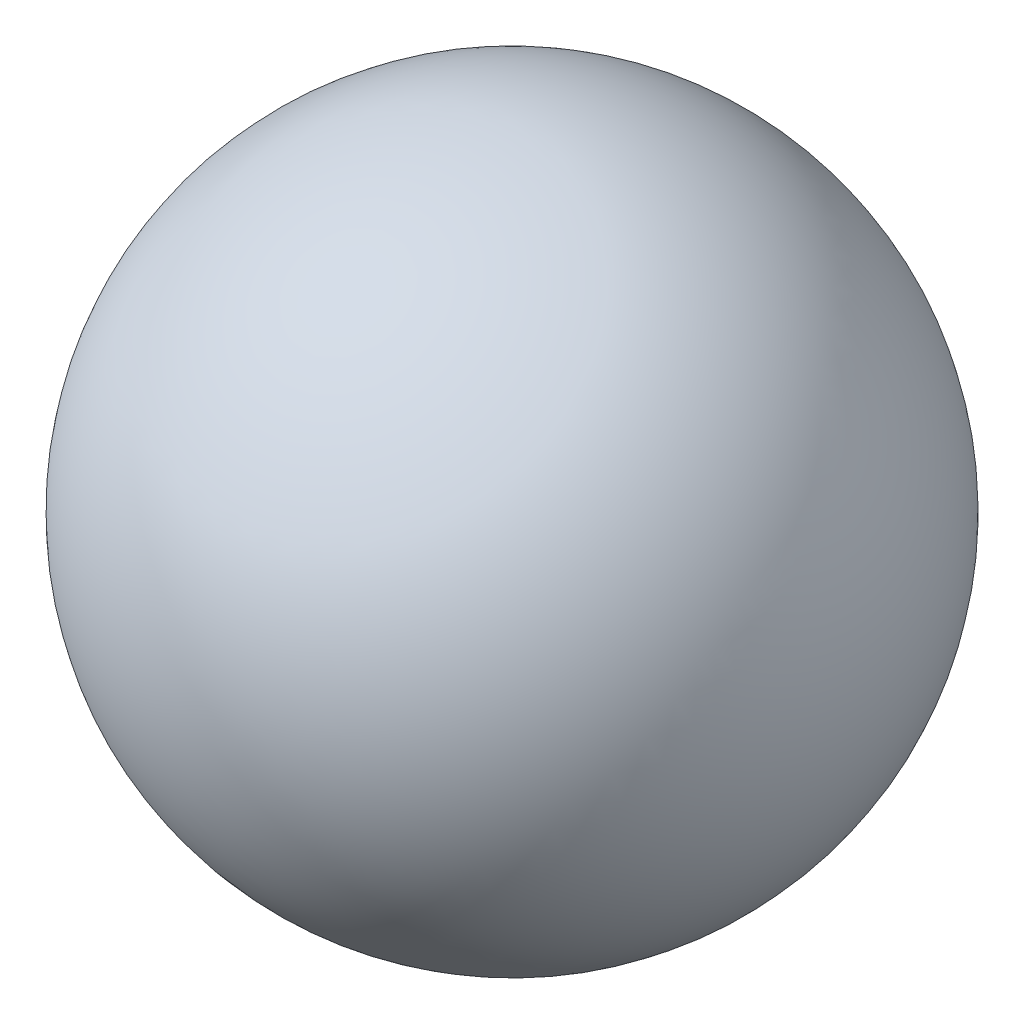
ISO-10303-21;
HEADER;
FILE_DESCRIPTION(('STEP AP214'),'2;1');
FILE_NAME('part.step','',(''),(''),'','','');
FILE_SCHEMA(('AUTOMOTIVE_DESIGN { 1 0 10303 214 1 1 1 1 }'));
ENDSEC;
DATA;
#1=APPLICATION_CONTEXT('core data for automotive mechanical design processes');
#2=APPLICATION_PROTOCOL_DEFINITION('international standard','automotive_design',2000,#1);
#3=PRODUCT_CONTEXT('',#1,'mechanical');
#4=PRODUCT('Part','Part','',(#3));
#5=PRODUCT_RELATED_PRODUCT_CATEGORY('part','',(#4));
#6=PRODUCT_DEFINITION_FORMATION('','',#4);
#7=PRODUCT_DEFINITION_CONTEXT('part definition',#1,'design');
#8=PRODUCT_DEFINITION('design','',#6,#7);
#9=PRODUCT_DEFINITION_SHAPE('','',#8);
#10=(LENGTH_UNIT() NAMED_UNIT(*) SI_UNIT(.MILLI.,.METRE.));
#11=(NAMED_UNIT(*) PLANE_ANGLE_UNIT() SI_UNIT($,.RADIAN.));
#12=(NAMED_UNIT(*) SI_UNIT($,.STERADIAN.) SOLID_ANGLE_UNIT());
#13=UNCERTAINTY_MEASURE_WITH_UNIT(LENGTH_MEASURE(1.E-05),#10,'distance_accuracy_value','');
#14=(GEOMETRIC_REPRESENTATION_CONTEXT(3) GLOBAL_UNCERTAINTY_ASSIGNED_CONTEXT((#13)) GLOBAL_UNIT_ASSIGNED_CONTEXT((#10,
#11,#12)) REPRESENTATION_CONTEXT('',''));
#15=CARTESIAN_POINT('',(0.,0.,0.));
#16=DIRECTION('',(0.,0.,1.));
#17=DIRECTION('',(1.,0.,0.));
#18=AXIS2_PLACEMENT_3D('',#15,#16,#17);
#19=CARTESIAN_POINT('',(0.,0.,0.));
#20=DIRECTION('',(0.538473088805822,0.771240646249921,0.339462219111232));
#21=DIRECTION('',(0.0279222082174022,-0.418964193495674,0.907573333046308));
#22=AXIS2_PLACEMENT_3D('',#19,#20,#21);
#23=SPHERICAL_SURFACE('',#22,1.1905);
#24=CARTESIAN_POINT('',(0.641052212223331,0.918161989360532,0.404129771851921));
#25=VERTEX_POINT('',#24);
#26=VERTEX_LOOP('',#25);
#27=FACE_BOUND('',#26,.T.);
#28=CARTESIAN_POINT('',(-0.641052212223331,-0.91816198936053,-0.404129771851921));
#29=VERTEX_POINT('',#28);
#30=VERTEX_LOOP('',#29);
#31=FACE_BOUND('',#30,.T.);
#32=ADVANCED_FACE('F15',(#27,#31),#23,.T.);
#33=CLOSED_SHELL('',(#32));
#34=MANIFOLD_SOLID_BREP('B1',#33);
#35=ADVANCED_BREP_SHAPE_REPRESENTATION('',(#18,#34),#14);
#36=SHAPE_DEFINITION_REPRESENTATION(#9,#35);
ENDSEC;
END-ISO-10303-21;
